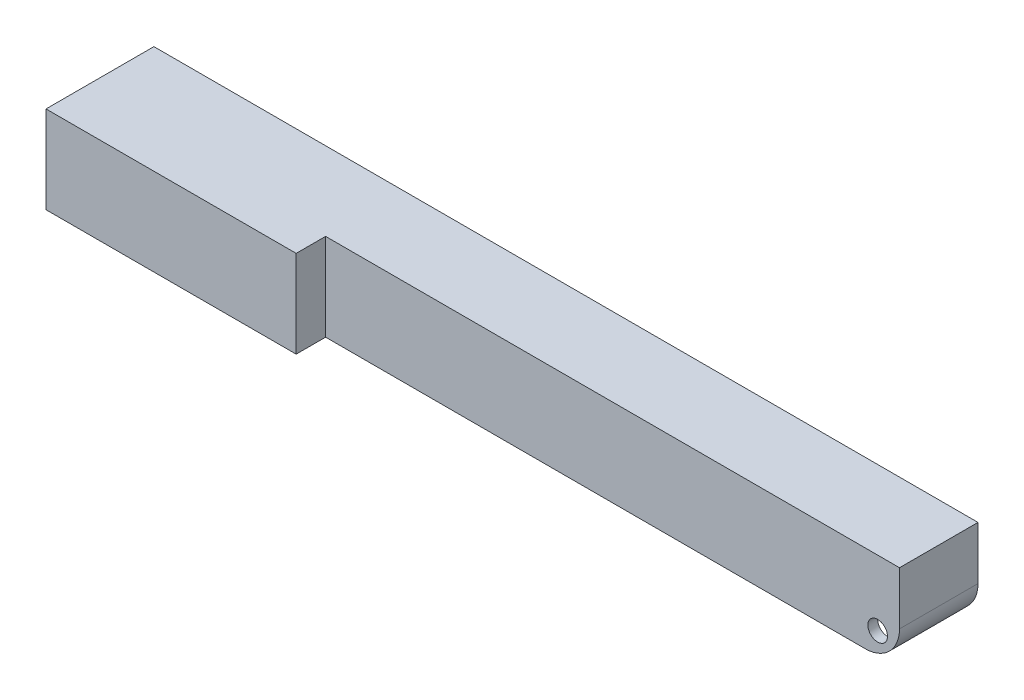
ISO-10303-21;
HEADER;
FILE_DESCRIPTION(('STEP AP214'),'2;1');
FILE_NAME('part.step','',(''),(''),'','','');
FILE_SCHEMA(('AUTOMOTIVE_DESIGN { 1 0 10303 214 1 1 1 1 }'));
ENDSEC;
DATA;
#1=APPLICATION_CONTEXT('core data for automotive mechanical design processes');
#2=APPLICATION_PROTOCOL_DEFINITION('international standard','automotive_design',2000,#1);
#3=PRODUCT_CONTEXT('',#1,'mechanical');
#4=PRODUCT('Part','Part','',(#3));
#5=PRODUCT_RELATED_PRODUCT_CATEGORY('part','',(#4));
#6=PRODUCT_DEFINITION_FORMATION('','',#4);
#7=PRODUCT_DEFINITION_CONTEXT('part definition',#1,'design');
#8=PRODUCT_DEFINITION('design','',#6,#7);
#9=PRODUCT_DEFINITION_SHAPE('','',#8);
#10=(LENGTH_UNIT() NAMED_UNIT(*) SI_UNIT(.MILLI.,.METRE.));
#11=(NAMED_UNIT(*) PLANE_ANGLE_UNIT() SI_UNIT($,.RADIAN.));
#12=(NAMED_UNIT(*) SI_UNIT($,.STERADIAN.) SOLID_ANGLE_UNIT());
#13=UNCERTAINTY_MEASURE_WITH_UNIT(LENGTH_MEASURE(1.E-05),#10,'distance_accuracy_value','');
#14=(GEOMETRIC_REPRESENTATION_CONTEXT(3) GLOBAL_UNCERTAINTY_ASSIGNED_CONTEXT((#13)) GLOBAL_UNIT_ASSIGNED_CONTEXT((#10,
#11,#12)) REPRESENTATION_CONTEXT('',''));
#15=CARTESIAN_POINT('',(0.,0.,0.));
#16=DIRECTION('',(0.,0.,1.));
#17=DIRECTION('',(1.,0.,0.));
#18=AXIS2_PLACEMENT_3D('',#15,#16,#17);
#19=CARTESIAN_POINT('',(-82.,164.984847789123,-9.));
#20=DIRECTION('',(0.,0.,-1.));
#21=DIRECTION('',(-1.,0.,0.));
#22=AXIS2_PLACEMENT_3D('',#19,#20,#21);
#23=PLANE('',#22);
#24=CARTESIAN_POINT('',(79.55,-13.35,-9.));
#25=DIRECTION('',(0.,0.,-1.));
#26=DIRECTION('',(-1.,0.,0.));
#27=AXIS2_PLACEMENT_3D('',#24,#25,#26);
#28=CIRCLE('',#27,2.);
#29=CARTESIAN_POINT('',(77.55,-13.35,-9.));
#30=VERTEX_POINT('',#29);
#31=EDGE_CURVE('E311',#30,#30,#28,.F.);
#32=ORIENTED_EDGE('',*,*,#31,.F.);
#33=EDGE_LOOP('',(#32));
#34=FACE_BOUND('',#33,.T.);
#35=DIRECTION('',(1.,0.,0.));
#36=VECTOR('',#35,1.);
#37=CARTESIAN_POINT('',(-82.,-17.8,-9.));
#38=LINE('',#37,#36);
#39=CARTESIAN_POINT('',(-82.,-17.8,-9.));
#40=VERTEX_POINT('',#39);
#41=CARTESIAN_POINT('',(77.,-17.8,-9.));
#42=VERTEX_POINT('',#41);
#43=EDGE_CURVE('E248',#40,#42,#38,.T.);
#44=ORIENTED_EDGE('',*,*,#43,.T.);
#45=CARTESIAN_POINT('',(77.,-10.8,-9.));
#46=DIRECTION('',(0.,0.,-1.));
#47=DIRECTION('',(-1.,0.,0.));
#48=AXIS2_PLACEMENT_3D('',#45,#46,#47);
#49=CIRCLE('',#48,7.);
#50=CARTESIAN_POINT('',(82.,-15.6989794855664,-9.));
#51=VERTEX_POINT('',#50);
#52=EDGE_CURVE('E71',#42,#51,#49,.F.);
#53=ORIENTED_EDGE('',*,*,#52,.T.);
#54=DIRECTION('',(0.,-1.,0.));
#55=VECTOR('',#54,1.);
#56=CARTESIAN_POINT('',(82.,164.984847789123,-9.));
#57=LINE('',#56,#55);
#58=CARTESIAN_POINT('',(82.,-2.,-9.));
#59=VERTEX_POINT('',#58);
#60=EDGE_CURVE('E279',#59,#51,#57,.T.);
#61=ORIENTED_EDGE('',*,*,#60,.F.);
#62=DIRECTION('',(1.,0.,0.));
#63=VECTOR('',#62,1.);
#64=CARTESIAN_POINT('',(-82.,-2.,-9.));
#65=LINE('',#64,#63);
#66=CARTESIAN_POINT('',(-82.,-2.,-9.));
#67=VERTEX_POINT('',#66);
#68=EDGE_CURVE('E280',#67,#59,#65,.T.);
#69=ORIENTED_EDGE('',*,*,#68,.F.);
#70=DIRECTION('',(0.,-1.,0.));
#71=VECTOR('',#70,1.);
#72=CARTESIAN_POINT('',(-82.,164.984847789123,-9.));
#73=LINE('',#72,#71);
#74=CARTESIAN_POINT('',(-82.,-12.3,-9.));
#75=VERTEX_POINT('',#74);
#76=EDGE_CURVE('E284',#67,#75,#73,.T.);
#77=ORIENTED_EDGE('',*,*,#76,.T.);
#78=DIRECTION('',(1.,0.,0.));
#79=VECTOR('',#78,1.);
#80=CARTESIAN_POINT('',(-35.,-12.3,-9.));
#81=LINE('',#80,#79);
#82=CARTESIAN_POINT('',(-35.,-12.3,-9.));
#83=VERTEX_POINT('',#82);
#84=EDGE_CURVE('E215',#75,#83,#81,.T.);
#85=ORIENTED_EDGE('',*,*,#84,.T.);
#86=DIRECTION('',(0.,-1.,0.));
#87=VECTOR('',#86,1.);
#88=CARTESIAN_POINT('',(-35.,-12.3,-9.));
#89=LINE('',#88,#87);
#90=CARTESIAN_POINT('',(-35.,-14.3,-9.));
#91=VERTEX_POINT('',#90);
#92=EDGE_CURVE('E224',#83,#91,#89,.T.);
#93=ORIENTED_EDGE('',*,*,#92,.T.);
#94=DIRECTION('',(-1.,0.,0.));
#95=VECTOR('',#94,1.);
#96=CARTESIAN_POINT('',(-35.,-14.3,-9.));
#97=LINE('',#96,#95);
#98=CARTESIAN_POINT('',(-82.,-14.3,-9.));
#99=VERTEX_POINT('',#98);
#100=EDGE_CURVE('E210',#91,#99,#97,.T.);
#101=ORIENTED_EDGE('',*,*,#100,.T.);
#102=EDGE_CURVE('E199',#99,#40,#73,.T.);
#103=ORIENTED_EDGE('',*,*,#102,.T.);
#104=EDGE_LOOP('',(#44,#53,#61,#69,#77,#85,#93,#101,#103));
#105=FACE_BOUND('',#104,.T.);
#106=ADVANCED_FACE('F47',(#34,#105),#23,.F.);
#107=CARTESIAN_POINT('',(-82.,164.984847789123,8.99999999999999));
#108=DIRECTION('',(-1.,0.,0.));
#109=DIRECTION('',(0.,0.,1.));
#110=AXIS2_PLACEMENT_3D('',#107,#108,#109);
#111=PLANE('',#110);
#112=DIRECTION('',(0.,0.,1.));
#113=VECTOR('',#112,1.);
#114=CARTESIAN_POINT('',(-82.,-12.3,-56.0425339453563));
#115=LINE('',#114,#113);
#116=CARTESIAN_POINT('',(-82.,-12.3,8.99999999999999));
#117=VERTEX_POINT('',#116);
#118=EDGE_CURVE('E203',#75,#117,#115,.T.);
#119=ORIENTED_EDGE('',*,*,#118,.F.);
#120=ORIENTED_EDGE('',*,*,#76,.F.);
#121=DIRECTION('',(0.,0.,-1.));
#122=VECTOR('',#121,1.);
#123=CARTESIAN_POINT('',(-82.,-2.,8.99999999999999));
#124=LINE('',#123,#122);
#125=CARTESIAN_POINT('',(-82.,-2.,8.99999999999999));
#126=VERTEX_POINT('',#125);
#127=EDGE_CURVE('E244',#126,#67,#124,.T.);
#128=ORIENTED_EDGE('',*,*,#127,.F.);
#129=DIRECTION('',(0.,-1.,0.));
#130=VECTOR('',#129,1.);
#131=CARTESIAN_POINT('',(-82.,164.984847789123,8.99999999999999));
#132=LINE('',#131,#130);
#133=EDGE_CURVE('E192',#126,#117,#132,.T.);
#134=ORIENTED_EDGE('',*,*,#133,.T.);
#135=EDGE_LOOP('',(#119,#120,#128,#134));
#136=FACE_BOUND('',#135,.T.);
#137=ADVANCED_FACE('F467',(#136),#111,.F.);
#138=DIRECTION('',(0.,0.,1.));
#139=VECTOR('',#138,1.);
#140=CARTESIAN_POINT('',(-82.,-14.3,-56.0425339453563));
#141=LINE('',#140,#139);
#142=CARTESIAN_POINT('',(-82.,-14.3,8.99999999999999));
#143=VERTEX_POINT('',#142);
#144=EDGE_CURVE('E197',#99,#143,#141,.T.);
#145=ORIENTED_EDGE('',*,*,#144,.T.);
#146=CARTESIAN_POINT('',(-82.,-17.8,8.99999999999999));
#147=VERTEX_POINT('',#146);
#148=EDGE_CURVE('E180',#143,#147,#132,.T.);
#149=ORIENTED_EDGE('',*,*,#148,.T.);
#150=DIRECTION('',(0.,0.,-1.));
#151=VECTOR('',#150,1.);
#152=CARTESIAN_POINT('',(-82.,-17.8,8.99999999999999));
#153=LINE('',#152,#151);
#154=EDGE_CURVE('E251',#147,#40,#153,.T.);
#155=ORIENTED_EDGE('',*,*,#154,.T.);
#156=ORIENTED_EDGE('',*,*,#102,.F.);
#157=EDGE_LOOP('',(#145,#149,#155,#156));
#158=FACE_BOUND('',#157,.T.);
#159=ADVANCED_FACE('F198',(#158),#111,.F.);
#160=CARTESIAN_POINT('',(-35.,164.984847789123,2.99999999999999));
#161=DIRECTION('',(1.,0.,0.));
#162=DIRECTION('',(0.,0.,-1.));
#163=AXIS2_PLACEMENT_3D('',#160,#161,#162);
#164=PLANE('',#163);
#165=DIRECTION('',(0.,0.,1.));
#166=VECTOR('',#165,1.);
#167=CARTESIAN_POINT('',(-35.,-12.3,-56.0425339453563));
#168=LINE('',#167,#166);
#169=CARTESIAN_POINT('',(-35.,-12.3,2.99999999999999));
#170=VERTEX_POINT('',#169);
#171=CARTESIAN_POINT('',(-35.,-12.3,8.99999999999999));
#172=VERTEX_POINT('',#171);
#173=EDGE_CURVE('E223',#170,#172,#168,.T.);
#174=ORIENTED_EDGE('',*,*,#173,.T.);
#175=DIRECTION('',(0.,-1.,0.));
#176=VECTOR('',#175,1.);
#177=CARTESIAN_POINT('',(-35.,164.984847789123,8.99999999999999));
#178=LINE('',#177,#176);
#179=CARTESIAN_POINT('',(-35.,-2.,8.99999999999999));
#180=VERTEX_POINT('',#179);
#181=EDGE_CURVE('E262',#180,#172,#178,.T.);
#182=ORIENTED_EDGE('',*,*,#181,.F.);
#183=DIRECTION('',(0.,0.,1.));
#184=VECTOR('',#183,1.);
#185=CARTESIAN_POINT('',(-35.,-2.,2.99999999999999));
#186=LINE('',#185,#184);
#187=CARTESIAN_POINT('',(-35.,-2.,2.99999999999999));
#188=VERTEX_POINT('',#187);
#189=EDGE_CURVE('E263',#188,#180,#186,.T.);
#190=ORIENTED_EDGE('',*,*,#189,.F.);
#191=DIRECTION('',(0.,-1.,0.));
#192=VECTOR('',#191,1.);
#193=CARTESIAN_POINT('',(-35.,164.984847789123,2.99999999999999));
#194=LINE('',#193,#192);
#195=EDGE_CURVE('E268',#188,#170,#194,.T.);
#196=ORIENTED_EDGE('',*,*,#195,.T.);
#197=EDGE_LOOP('',(#174,#182,#190,#196));
#198=FACE_BOUND('',#197,.T.);
#199=ADVANCED_FACE('F458',(#198),#164,.F.);
#200=DIRECTION('',(0.,0.,1.));
#201=VECTOR('',#200,1.);
#202=CARTESIAN_POINT('',(-35.,-14.3,-56.0425339453563));
#203=LINE('',#202,#201);
#204=CARTESIAN_POINT('',(-35.,-14.3,2.99999999999999));
#205=VERTEX_POINT('',#204);
#206=CARTESIAN_POINT('',(-35.,-14.3,8.99999999999999));
#207=VERTEX_POINT('',#206);
#208=EDGE_CURVE('E208',#205,#207,#203,.T.);
#209=ORIENTED_EDGE('',*,*,#208,.F.);
#210=CARTESIAN_POINT('',(-35.,-17.8,2.99999999999999));
#211=VERTEX_POINT('',#210);
#212=EDGE_CURVE('E273',#205,#211,#194,.T.);
#213=ORIENTED_EDGE('',*,*,#212,.T.);
#214=DIRECTION('',(0.,0.,1.));
#215=VECTOR('',#214,1.);
#216=CARTESIAN_POINT('',(-35.,-17.8,2.99999999999999));
#217=LINE('',#216,#215);
#218=CARTESIAN_POINT('',(-35.,-17.8,8.99999999999999));
#219=VERTEX_POINT('',#218);
#220=EDGE_CURVE('E240',#211,#219,#217,.T.);
#221=ORIENTED_EDGE('',*,*,#220,.T.);
#222=EDGE_CURVE('E267',#207,#219,#178,.T.);
#223=ORIENTED_EDGE('',*,*,#222,.F.);
#224=EDGE_LOOP('',(#209,#213,#221,#223));
#225=FACE_BOUND('',#224,.T.);
#226=ADVANCED_FACE('F443',(#225),#164,.F.);
#227=CARTESIAN_POINT('',(-35.,164.984847789123,8.99999999999999));
#228=DIRECTION('',(0.,0.,1.));
#229=DIRECTION('',(1.,0.,0.));
#230=AXIS2_PLACEMENT_3D('',#227,#228,#229);
#231=PLANE('',#230);
#232=DIRECTION('',(1.,0.,0.));
#233=VECTOR('',#232,1.);
#234=CARTESIAN_POINT('',(-35.,-12.3,8.99999999999999));
#235=LINE('',#234,#233);
#236=EDGE_CURVE('E219',#117,#172,#235,.T.);
#237=ORIENTED_EDGE('',*,*,#236,.F.);
#238=ORIENTED_EDGE('',*,*,#133,.F.);
#239=DIRECTION('',(-1.,0.,0.));
#240=VECTOR('',#239,1.);
#241=CARTESIAN_POINT('',(-35.,-2.,8.99999999999999));
#242=LINE('',#241,#240);
#243=EDGE_CURVE('E193',#180,#126,#242,.T.);
#244=ORIENTED_EDGE('',*,*,#243,.F.);
#245=ORIENTED_EDGE('',*,*,#181,.T.);
#246=EDGE_LOOP('',(#237,#238,#244,#245));
#247=FACE_BOUND('',#246,.T.);
#248=ADVANCED_FACE('F460',(#247),#231,.F.);
#249=DIRECTION('',(-1.,0.,0.));
#250=VECTOR('',#249,1.);
#251=CARTESIAN_POINT('',(-35.,-14.3,8.99999999999999));
#252=LINE('',#251,#250);
#253=EDGE_CURVE('E184',#207,#143,#252,.T.);
#254=ORIENTED_EDGE('',*,*,#253,.F.);
#255=ORIENTED_EDGE('',*,*,#222,.T.);
#256=DIRECTION('',(-1.,0.,0.));
#257=VECTOR('',#256,1.);
#258=CARTESIAN_POINT('',(-35.,-17.8,8.99999999999999));
#259=LINE('',#258,#257);
#260=EDGE_CURVE('E187',#219,#147,#259,.T.);
#261=ORIENTED_EDGE('',*,*,#260,.T.);
#262=ORIENTED_EDGE('',*,*,#148,.F.);
#263=EDGE_LOOP('',(#254,#255,#261,#262));
#264=FACE_BOUND('',#263,.T.);
#265=ADVANCED_FACE('F182',(#264),#231,.F.);
#266=CARTESIAN_POINT('',(79.55,-13.35,-16.6568542494924));
#267=DIRECTION('',(0.,0.,1.));
#268=DIRECTION('',(1.,0.,0.));
#269=AXIS2_PLACEMENT_3D('',#266,#267,#268);
#270=CYLINDRICAL_SURFACE('',#269,2.);
#271=ORIENTED_EDGE('',*,*,#31,.T.);
#272=EDGE_LOOP('',(#271));
#273=FACE_BOUND('',#272,.T.);
#274=CARTESIAN_POINT('',(79.55,-13.35,-11.));
#275=DIRECTION('',(0.,0.,1.));
#276=DIRECTION('',(1.,0.,0.));
#277=AXIS2_PLACEMENT_3D('',#274,#275,#276);
#278=CIRCLE('',#277,2.);
#279=CARTESIAN_POINT('',(81.55,-13.35,-11.));
#280=VERTEX_POINT('',#279);
#281=EDGE_CURVE('E327',#280,#280,#278,.F.);
#282=ORIENTED_EDGE('',*,*,#281,.T.);
#283=EDGE_LOOP('',(#282));
#284=FACE_BOUND('',#283,.T.);
#285=ADVANCED_FACE('F488',(#273,#284),#270,.F.);
#286=CARTESIAN_POINT('',(-84.,-17.8,11.));
#287=DIRECTION('',(0.,0.,1.));
#288=DIRECTION('',(1.,0.,0.));
#289=AXIS2_PLACEMENT_3D('',#286,#287,#288);
#290=PLANE('',#289);
#291=DIRECTION('',(0.,1.,0.));
#292=VECTOR('',#291,1.);
#293=CARTESIAN_POINT('',(-33.,-134.9537451386,11.));
#294=LINE('',#293,#292);
#295=CARTESIAN_POINT('',(-33.,-17.8,11.));
#296=VERTEX_POINT('',#295);
#297=CARTESIAN_POINT('',(-33.,0.,11.));
#298=VERTEX_POINT('',#297);
#299=EDGE_CURVE('E305',#296,#298,#294,.T.);
#300=ORIENTED_EDGE('',*,*,#299,.T.);
#301=DIRECTION('',(1.,0.,0.));
#302=VECTOR('',#301,1.);
#303=CARTESIAN_POINT('',(-84.,0.,11.));
#304=LINE('',#303,#302);
#305=CARTESIAN_POINT('',(-84.,0.,11.));
#306=VERTEX_POINT('',#305);
#307=EDGE_CURVE('E331',#306,#298,#304,.T.);
#308=ORIENTED_EDGE('',*,*,#307,.F.);
#309=DIRECTION('',(0.,1.,0.));
#310=VECTOR('',#309,1.);
#311=CARTESIAN_POINT('',(-84.,-17.8,11.));
#312=LINE('',#311,#310);
#313=CARTESIAN_POINT('',(-84.,-17.8,11.));
#314=VERTEX_POINT('',#313);
#315=EDGE_CURVE('E358',#314,#306,#312,.T.);
#316=ORIENTED_EDGE('',*,*,#315,.F.);
#317=DIRECTION('',(1.,0.,0.));
#318=VECTOR('',#317,1.);
#319=CARTESIAN_POINT('',(-84.,-17.8,11.));
#320=LINE('',#319,#318);
#321=EDGE_CURVE('E332',#314,#296,#320,.T.);
#322=ORIENTED_EDGE('',*,*,#321,.T.);
#323=EDGE_LOOP('',(#300,#308,#316,#322));
#324=FACE_BOUND('',#323,.T.);
#325=ADVANCED_FACE('F433',(#324),#290,.T.);
#326=CARTESIAN_POINT('',(-84.,-17.8,11.));
#327=DIRECTION('',(1.,0.,0.));
#328=DIRECTION('',(0.,0.,-1.));
#329=AXIS2_PLACEMENT_3D('',#326,#327,#328);
#330=PLANE('',#329);
#331=DIRECTION('',(0.,0.,-1.));
#332=VECTOR('',#331,1.);
#333=CARTESIAN_POINT('',(-84.,0.,11.));
#334=LINE('',#333,#332);
#335=CARTESIAN_POINT('',(-84.,0.,-11.));
#336=VERTEX_POINT('',#335);
#337=EDGE_CURVE('E337',#306,#336,#334,.T.);
#338=ORIENTED_EDGE('',*,*,#337,.T.);
#339=DIRECTION('',(0.,1.,0.));
#340=VECTOR('',#339,1.);
#341=CARTESIAN_POINT('',(-84.,-17.8,-11.));
#342=LINE('',#341,#340);
#343=CARTESIAN_POINT('',(-84.,-17.8,-11.));
#344=VERTEX_POINT('',#343);
#345=EDGE_CURVE('E362',#344,#336,#342,.T.);
#346=ORIENTED_EDGE('',*,*,#345,.F.);
#347=DIRECTION('',(0.,0.,-1.));
#348=VECTOR('',#347,1.);
#349=CARTESIAN_POINT('',(-84.,-17.8,11.));
#350=LINE('',#349,#348);
#351=EDGE_CURVE('E341',#314,#344,#350,.T.);
#352=ORIENTED_EDGE('',*,*,#351,.F.);
#353=ORIENTED_EDGE('',*,*,#315,.T.);
#354=EDGE_LOOP('',(#338,#346,#352,#353));
#355=FACE_BOUND('',#354,.T.);
#356=ADVANCED_FACE('F429',(#355),#330,.F.);
#357=CARTESIAN_POINT('',(-84.,-17.8,-11.));
#358=DIRECTION('',(0.,0.,1.));
#359=DIRECTION('',(1.,0.,0.));
#360=AXIS2_PLACEMENT_3D('',#357,#358,#359);
#361=PLANE('',#360);
#362=ORIENTED_EDGE('',*,*,#281,.F.);
#363=EDGE_LOOP('',(#362));
#364=FACE_BOUND('',#363,.T.);
#365=DIRECTION('',(0.,1.,0.));
#366=VECTOR('',#365,1.);
#367=CARTESIAN_POINT('',(84.,-17.8,-11.));
#368=LINE('',#367,#366);
#369=CARTESIAN_POINT('',(84.,-10.8,-11.));
#370=VERTEX_POINT('',#369);
#371=CARTESIAN_POINT('',(84.,0.,-11.));
#372=VERTEX_POINT('',#371);
#373=EDGE_CURVE('E344',#370,#372,#368,.T.);
#374=ORIENTED_EDGE('',*,*,#373,.F.);
#375=CARTESIAN_POINT('',(77.,-10.8,-11.));
#376=DIRECTION('',(0.,0.,1.));
#377=DIRECTION('',(1.,0.,0.));
#378=AXIS2_PLACEMENT_3D('',#375,#376,#377);
#379=CIRCLE('',#378,7.);
#380=CARTESIAN_POINT('',(77.,-17.8,-11.));
#381=VERTEX_POINT('',#380);
#382=EDGE_CURVE('E380',#370,#381,#379,.F.);
#383=ORIENTED_EDGE('',*,*,#382,.T.);
#384=DIRECTION('',(1.,0.,0.));
#385=VECTOR('',#384,1.);
#386=CARTESIAN_POINT('',(-84.,-17.8,-11.));
#387=LINE('',#386,#385);
#388=EDGE_CURVE('E336',#344,#381,#387,.T.);
#389=ORIENTED_EDGE('',*,*,#388,.F.);
#390=ORIENTED_EDGE('',*,*,#345,.T.);
#391=DIRECTION('',(1.,0.,0.));
#392=VECTOR('',#391,1.);
#393=CARTESIAN_POINT('',(-84.,0.,-11.));
#394=LINE('',#393,#392);
#395=EDGE_CURVE('E352',#336,#372,#394,.T.);
#396=ORIENTED_EDGE('',*,*,#395,.T.);
#397=EDGE_LOOP('',(#374,#383,#389,#390,#396));
#398=FACE_BOUND('',#397,.T.);
#399=ADVANCED_FACE('F424',(#364,#398),#361,.F.);
#400=CARTESIAN_POINT('',(84.,-17.8,11.));
#401=DIRECTION('',(1.,0.,0.));
#402=DIRECTION('',(0.,0.,-1.));
#403=AXIS2_PLACEMENT_3D('',#400,#401,#402);
#404=PLANE('',#403);
#405=DIRECTION('',(0.,1.,0.));
#406=VECTOR('',#405,1.);
#407=CARTESIAN_POINT('',(84.,-134.9537451386,5.));
#408=LINE('',#407,#406);
#409=CARTESIAN_POINT('',(84.,-10.8,5.));
#410=VERTEX_POINT('',#409);
#411=CARTESIAN_POINT('',(84.,0.,5.));
#412=VERTEX_POINT('',#411);
#413=EDGE_CURVE('E314',#410,#412,#408,.T.);
#414=ORIENTED_EDGE('',*,*,#413,.F.);
#415=DIRECTION('',(0.,0.,-1.));
#416=VECTOR('',#415,1.);
#417=CARTESIAN_POINT('',(84.,-10.8,-11.));
#418=LINE('',#417,#416);
#419=EDGE_CURVE('E361',#410,#370,#418,.T.);
#420=ORIENTED_EDGE('',*,*,#419,.T.);
#421=ORIENTED_EDGE('',*,*,#373,.T.);
#422=DIRECTION('',(0.,0.,-1.));
#423=VECTOR('',#422,1.);
#424=CARTESIAN_POINT('',(84.,0.,11.));
#425=LINE('',#424,#423);
#426=EDGE_CURVE('E348',#412,#372,#425,.T.);
#427=ORIENTED_EDGE('',*,*,#426,.F.);
#428=EDGE_LOOP('',(#414,#420,#421,#427));
#429=FACE_BOUND('',#428,.T.);
#430=ADVANCED_FACE('F416',(#429),#404,.T.);
#431=CARTESIAN_POINT('',(0.,-17.8,0.));
#432=DIRECTION('',(0.,1.,0.));
#433=DIRECTION('',(0.,0.,1.));
#434=AXIS2_PLACEMENT_3D('',#431,#432,#433);
#435=PLANE('',#434);
#436=ORIENTED_EDGE('',*,*,#388,.T.);
#437=DIRECTION('',(0.,0.,-1.));
#438=VECTOR('',#437,1.);
#439=CARTESIAN_POINT('',(77.,-17.8,5.));
#440=LINE('',#439,#438);
#441=EDGE_CURVE('E386',#381,#42,#440,.F.);
#442=ORIENTED_EDGE('',*,*,#441,.T.);
#443=ORIENTED_EDGE('',*,*,#43,.F.);
#444=ORIENTED_EDGE('',*,*,#154,.F.);
#445=ORIENTED_EDGE('',*,*,#260,.F.);
#446=ORIENTED_EDGE('',*,*,#220,.F.);
#447=DIRECTION('',(-1.,0.,0.));
#448=VECTOR('',#447,1.);
#449=CARTESIAN_POINT('',(82.,-17.8,3.));
#450=LINE('',#449,#448);
#451=CARTESIAN_POINT('',(77.,-17.8,3.));
#452=VERTEX_POINT('',#451);
#453=EDGE_CURVE('E245',#452,#211,#450,.T.);
#454=ORIENTED_EDGE('',*,*,#453,.F.);
#455=DIRECTION('',(0.,0.,-1.));
#456=VECTOR('',#455,1.);
#457=CARTESIAN_POINT('',(77.,-17.8,5.));
#458=LINE('',#457,#456);
#459=CARTESIAN_POINT('',(77.,-17.8,5.));
#460=VERTEX_POINT('',#459);
#461=EDGE_CURVE('E383',#452,#460,#458,.F.);
#462=ORIENTED_EDGE('',*,*,#461,.T.);
#463=DIRECTION('',(1.,0.,0.));
#464=VECTOR('',#463,1.);
#465=CARTESIAN_POINT('',(-33.,-17.8,5.));
#466=LINE('',#465,#464);
#467=CARTESIAN_POINT('',(-33.,-17.8,5.));
#468=VERTEX_POINT('',#467);
#469=EDGE_CURVE('E304',#468,#460,#466,.T.);
#470=ORIENTED_EDGE('',*,*,#469,.F.);
#471=DIRECTION('',(0.,0.,-1.));
#472=VECTOR('',#471,1.);
#473=CARTESIAN_POINT('',(-33.,-17.8,5.));
#474=LINE('',#473,#472);
#475=EDGE_CURVE('E301',#296,#468,#474,.T.);
#476=ORIENTED_EDGE('',*,*,#475,.F.);
#477=ORIENTED_EDGE('',*,*,#321,.F.);
#478=ORIENTED_EDGE('',*,*,#351,.T.);
#479=EDGE_LOOP('',(#436,#442,#443,#444,#445,#446,#454,#462,#470,#476,#477,#478));
#480=FACE_BOUND('',#479,.T.);
#481=ADVANCED_FACE('F404',(#480),#435,.F.);
#482=CARTESIAN_POINT('',(0.,0.,0.));
#483=DIRECTION('',(0.,1.,0.));
#484=DIRECTION('',(0.,0.,1.));
#485=AXIS2_PLACEMENT_3D('',#482,#483,#484);
#486=PLANE('',#485);
#487=DIRECTION('',(0.,0.,1.));
#488=VECTOR('',#487,1.);
#489=CARTESIAN_POINT('',(-33.,0.,5.));
#490=LINE('',#489,#488);
#491=CARTESIAN_POINT('',(-33.,0.,5.));
#492=VERTEX_POINT('',#491);
#493=EDGE_CURVE('E310',#492,#298,#490,.T.);
#494=ORIENTED_EDGE('',*,*,#493,.F.);
#495=DIRECTION('',(-1.,0.,0.));
#496=VECTOR('',#495,1.);
#497=CARTESIAN_POINT('',(-33.,0.,5.));
#498=LINE('',#497,#496);
#499=EDGE_CURVE('E306',#412,#492,#498,.T.);
#500=ORIENTED_EDGE('',*,*,#499,.F.);
#501=ORIENTED_EDGE('',*,*,#426,.T.);
#502=ORIENTED_EDGE('',*,*,#395,.F.);
#503=ORIENTED_EDGE('',*,*,#337,.F.);
#504=ORIENTED_EDGE('',*,*,#307,.T.);
#505=EDGE_LOOP('',(#494,#500,#501,#502,#503,#504));
#506=FACE_BOUND('',#505,.T.);
#507=ADVANCED_FACE('F421',(#506),#486,.T.);
#508=CARTESIAN_POINT('',(79.55,-13.35,3.));
#509=DIRECTION('',(0.,0.,1.));
#510=DIRECTION('',(1.,0.,0.));
#511=AXIS2_PLACEMENT_3D('',#508,#509,#510);
#512=CIRCLE('',#511,2.);
#513=CARTESIAN_POINT('',(81.55,-13.35,3.));
#514=VERTEX_POINT('',#513);
#515=EDGE_CURVE('E300',#514,#514,#512,.F.);
#516=ORIENTED_EDGE('',*,*,#515,.T.);
#517=EDGE_LOOP('',(#516));
#518=FACE_BOUND('',#517,.T.);
#519=CARTESIAN_POINT('',(79.55,-13.35,5.));
#520=DIRECTION('',(0.,0.,-1.));
#521=DIRECTION('',(-1.,0.,0.));
#522=AXIS2_PLACEMENT_3D('',#519,#520,#521);
#523=CIRCLE('',#522,2.);
#524=CARTESIAN_POINT('',(77.55,-13.35,5.));
#525=VERTEX_POINT('',#524);
#526=EDGE_CURVE('E326',#525,#525,#523,.F.);
#527=ORIENTED_EDGE('',*,*,#526,.T.);
#528=EDGE_LOOP('',(#527));
#529=FACE_BOUND('',#528,.T.);
#530=ADVANCED_FACE('F484',(#518,#529),#270,.F.);
#531=CARTESIAN_POINT('',(-33.,-134.9537451386,5.));
#532=DIRECTION('',(0.,0.,-1.));
#533=DIRECTION('',(-1.,0.,0.));
#534=AXIS2_PLACEMENT_3D('',#531,#532,#533);
#535=PLANE('',#534);
#536=ORIENTED_EDGE('',*,*,#469,.T.);
#537=CARTESIAN_POINT('',(77.,-10.8,5.));
#538=DIRECTION('',(0.,0.,-1.));
#539=DIRECTION('',(-1.,0.,0.));
#540=AXIS2_PLACEMENT_3D('',#537,#538,#539);
#541=CIRCLE('',#540,7.);
#542=EDGE_CURVE('E12',#460,#410,#541,.F.);
#543=ORIENTED_EDGE('',*,*,#542,.T.);
#544=ORIENTED_EDGE('',*,*,#413,.T.);
#545=ORIENTED_EDGE('',*,*,#499,.T.);
#546=DIRECTION('',(0.,1.,0.));
#547=VECTOR('',#546,1.);
#548=CARTESIAN_POINT('',(-33.,-134.9537451386,5.));
#549=LINE('',#548,#547);
#550=EDGE_CURVE('E318',#468,#492,#549,.T.);
#551=ORIENTED_EDGE('',*,*,#550,.F.);
#552=EDGE_LOOP('',(#536,#543,#544,#545,#551));
#553=FACE_BOUND('',#552,.T.);
#554=ORIENTED_EDGE('',*,*,#526,.F.);
#555=EDGE_LOOP('',(#554));
#556=FACE_BOUND('',#555,.T.);
#557=ADVANCED_FACE('F410',(#553,#556),#535,.F.);
#558=CARTESIAN_POINT('',(-33.,-134.9537451386,5.));
#559=DIRECTION('',(-1.,0.,0.));
#560=DIRECTION('',(0.,0.,1.));
#561=AXIS2_PLACEMENT_3D('',#558,#559,#560);
#562=PLANE('',#561);
#563=ORIENTED_EDGE('',*,*,#475,.T.);
#564=ORIENTED_EDGE('',*,*,#550,.T.);
#565=ORIENTED_EDGE('',*,*,#493,.T.);
#566=ORIENTED_EDGE('',*,*,#299,.F.);
#567=EDGE_LOOP('',(#563,#564,#565,#566));
#568=FACE_BOUND('',#567,.T.);
#569=ADVANCED_FACE('F436',(#568),#562,.F.);
#570=CARTESIAN_POINT('',(82.,164.984847789123,3.));
#571=DIRECTION('',(0.,0.,1.));
#572=DIRECTION('',(1.,0.,0.));
#573=AXIS2_PLACEMENT_3D('',#570,#571,#572);
#574=PLANE('',#573);
#575=DIRECTION('',(0.,-1.,0.));
#576=VECTOR('',#575,1.);
#577=CARTESIAN_POINT('',(82.,164.984847789123,3.));
#578=LINE('',#577,#576);
#579=CARTESIAN_POINT('',(82.,-2.,3.));
#580=VERTEX_POINT('',#579);
#581=CARTESIAN_POINT('',(82.,-15.6989794855664,3.));
#582=VERTEX_POINT('',#581);
#583=EDGE_CURVE('E274',#580,#582,#578,.T.);
#584=ORIENTED_EDGE('',*,*,#583,.T.);
#585=CARTESIAN_POINT('',(77.,-10.8,3.));
#586=DIRECTION('',(0.,0.,1.));
#587=DIRECTION('',(1.,0.,0.));
#588=AXIS2_PLACEMENT_3D('',#585,#586,#587);
#589=CIRCLE('',#588,7.);
#590=EDGE_CURVE('E56',#582,#452,#589,.F.);
#591=ORIENTED_EDGE('',*,*,#590,.T.);
#592=ORIENTED_EDGE('',*,*,#453,.T.);
#593=ORIENTED_EDGE('',*,*,#212,.F.);
#594=DIRECTION('',(0.,-1.,0.));
#595=VECTOR('',#594,1.);
#596=CARTESIAN_POINT('',(-35.,164.984847789123,2.99999999999999));
#597=LINE('',#596,#595);
#598=EDGE_CURVE('E227',#170,#205,#597,.T.);
#599=ORIENTED_EDGE('',*,*,#598,.F.);
#600=ORIENTED_EDGE('',*,*,#195,.F.);
#601=DIRECTION('',(-1.,0.,0.));
#602=VECTOR('',#601,1.);
#603=CARTESIAN_POINT('',(82.,-2.,3.));
#604=LINE('',#603,#602);
#605=EDGE_CURVE('E269',#580,#188,#604,.T.);
#606=ORIENTED_EDGE('',*,*,#605,.F.);
#607=EDGE_LOOP('',(#584,#591,#592,#593,#599,#600,#606));
#608=FACE_BOUND('',#607,.T.);
#609=ORIENTED_EDGE('',*,*,#515,.F.);
#610=EDGE_LOOP('',(#609));
#611=FACE_BOUND('',#610,.T.);
#612=ADVANCED_FACE('F396',(#608,#611),#574,.F.);
#613=CARTESIAN_POINT('',(0.,-2.,0.));
#614=DIRECTION('',(0.,1.,0.));
#615=DIRECTION('',(0.,0.,1.));
#616=AXIS2_PLACEMENT_3D('',#613,#614,#615);
#617=PLANE('',#616);
#618=ORIENTED_EDGE('',*,*,#243,.T.);
#619=ORIENTED_EDGE('',*,*,#127,.T.);
#620=ORIENTED_EDGE('',*,*,#68,.T.);
#621=DIRECTION('',(0.,0.,1.));
#622=VECTOR('',#621,1.);
#623=CARTESIAN_POINT('',(82.,-2.,-9.));
#624=LINE('',#623,#622);
#625=EDGE_CURVE('E275',#59,#580,#624,.T.);
#626=ORIENTED_EDGE('',*,*,#625,.T.);
#627=ORIENTED_EDGE('',*,*,#605,.T.);
#628=ORIENTED_EDGE('',*,*,#189,.T.);
#629=EDGE_LOOP('',(#618,#619,#620,#626,#627,#628));
#630=FACE_BOUND('',#629,.T.);
#631=ADVANCED_FACE('F463',(#630),#617,.F.);
#632=CARTESIAN_POINT('',(82.,164.984847789123,-9.));
#633=DIRECTION('',(1.,0.,0.));
#634=DIRECTION('',(0.,0.,-1.));
#635=AXIS2_PLACEMENT_3D('',#632,#633,#634);
#636=PLANE('',#635);
#637=ORIENTED_EDGE('',*,*,#60,.T.);
#638=DIRECTION('',(0.,0.,1.));
#639=VECTOR('',#638,1.);
#640=CARTESIAN_POINT('',(82.,-15.6989794855664,-9.));
#641=LINE('',#640,#639);
#642=EDGE_CURVE('E63',#51,#582,#641,.T.);
#643=ORIENTED_EDGE('',*,*,#642,.T.);
#644=ORIENTED_EDGE('',*,*,#583,.F.);
#645=ORIENTED_EDGE('',*,*,#625,.F.);
#646=EDGE_LOOP('',(#637,#643,#644,#645));
#647=FACE_BOUND('',#646,.T.);
#648=ADVANCED_FACE('F464',(#647),#636,.F.);
#649=CARTESIAN_POINT('',(-35.,-12.3,-56.0425339453563));
#650=DIRECTION('',(-1.,0.,0.));
#651=DIRECTION('',(0.,0.,1.));
#652=AXIS2_PLACEMENT_3D('',#649,#650,#651);
#653=PLANE('',#652);
#654=EDGE_CURVE('E233',#83,#170,#168,.T.);
#655=ORIENTED_EDGE('',*,*,#654,.T.);
#656=ORIENTED_EDGE('',*,*,#598,.T.);
#657=EDGE_CURVE('E211',#91,#205,#203,.T.);
#658=ORIENTED_EDGE('',*,*,#657,.F.);
#659=ORIENTED_EDGE('',*,*,#92,.F.);
#660=EDGE_LOOP('',(#655,#656,#658,#659));
#661=FACE_BOUND('',#660,.T.);
#662=ADVANCED_FACE('F447',(#661),#653,.F.);
#663=CARTESIAN_POINT('',(-35.,-12.3,-56.0425339453563));
#664=DIRECTION('',(0.,-1.,0.));
#665=DIRECTION('',(0.,0.,-1.));
#666=AXIS2_PLACEMENT_3D('',#663,#664,#665);
#667=PLANE('',#666);
#668=ORIENTED_EDGE('',*,*,#84,.F.);
#669=ORIENTED_EDGE('',*,*,#118,.T.);
#670=ORIENTED_EDGE('',*,*,#236,.T.);
#671=ORIENTED_EDGE('',*,*,#173,.F.);
#672=ORIENTED_EDGE('',*,*,#654,.F.);
#673=EDGE_LOOP('',(#668,#669,#670,#671,#672));
#674=FACE_BOUND('',#673,.T.);
#675=ADVANCED_FACE('F453',(#674),#667,.F.);
#676=CARTESIAN_POINT('',(-35.,-14.3,-56.0425339453563));
#677=DIRECTION('',(0.,1.,0.));
#678=DIRECTION('',(0.,0.,1.));
#679=AXIS2_PLACEMENT_3D('',#676,#677,#678);
#680=PLANE('',#679);
#681=ORIENTED_EDGE('',*,*,#100,.F.);
#682=ORIENTED_EDGE('',*,*,#657,.T.);
#683=ORIENTED_EDGE('',*,*,#208,.T.);
#684=ORIENTED_EDGE('',*,*,#253,.T.);
#685=ORIENTED_EDGE('',*,*,#144,.F.);
#686=EDGE_LOOP('',(#681,#682,#683,#684,#685));
#687=FACE_BOUND('',#686,.T.);
#688=ADVANCED_FACE('F206',(#687),#680,.F.);
#689=CARTESIAN_POINT('',(77.,-10.8,11.));
#690=DIRECTION('',(0.,0.,1.));
#691=DIRECTION('',(1.,0.,0.));
#692=AXIS2_PLACEMENT_3D('',#689,#690,#691);
#693=CYLINDRICAL_SURFACE('',#692,7.);
#694=ORIENTED_EDGE('',*,*,#52,.F.);
#695=ORIENTED_EDGE('',*,*,#441,.F.);
#696=ORIENTED_EDGE('',*,*,#382,.F.);
#697=ORIENTED_EDGE('',*,*,#419,.F.);
#698=ORIENTED_EDGE('',*,*,#542,.F.);
#699=ORIENTED_EDGE('',*,*,#461,.F.);
#700=ORIENTED_EDGE('',*,*,#590,.F.);
#701=ORIENTED_EDGE('',*,*,#642,.F.);
#702=EDGE_LOOP('',(#694,#695,#696,#697,#698,#699,#700,#701));
#703=FACE_BOUND('',#702,.T.);
#704=ADVANCED_FACE('F49',(#703),#693,.T.);
#705=CLOSED_SHELL('',(#106,#137,#159,#199,#226,#248,#265,#285,#325,#356,#399,#430,#481,#507,
#530,#557,#569,#612,#631,#648,#662,#675,#688,#704));
#706=MANIFOLD_SOLID_BREP('B2',#705);
#707=ADVANCED_BREP_SHAPE_REPRESENTATION('',(#18,#706),#14);
#708=SHAPE_DEFINITION_REPRESENTATION(#9,#707);
ENDSEC;
END-ISO-10303-21;
